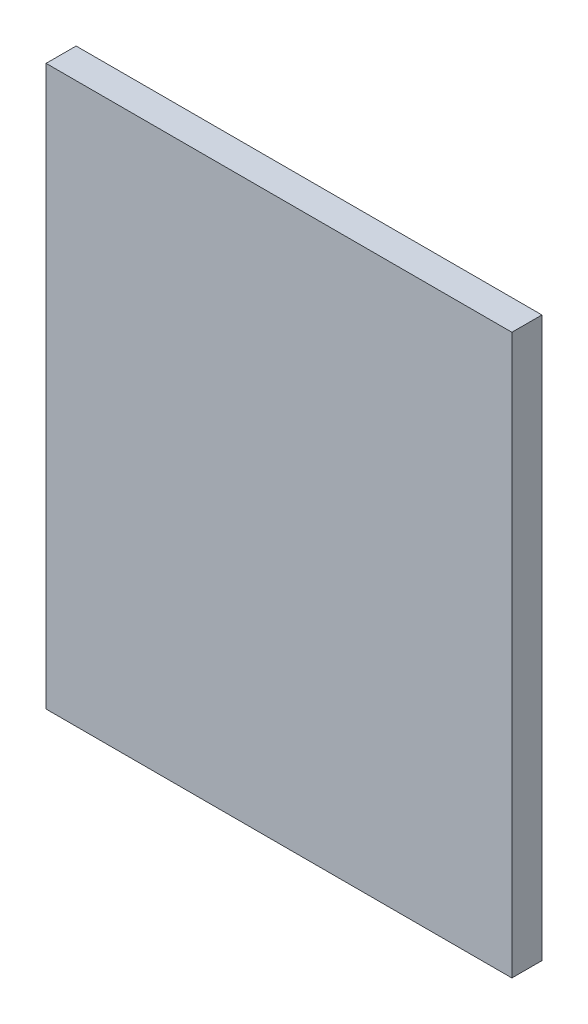
ISO-10303-21;
HEADER;
FILE_DESCRIPTION(('STEP AP214'),'2;1');
FILE_NAME('part.step','',(''),(''),'','','');
FILE_SCHEMA(('AUTOMOTIVE_DESIGN { 1 0 10303 214 1 1 1 1 }'));
ENDSEC;
DATA;
#1=APPLICATION_CONTEXT('core data for automotive mechanical design processes');
#2=APPLICATION_PROTOCOL_DEFINITION('international standard','automotive_design',2000,#1);
#3=PRODUCT_CONTEXT('',#1,'mechanical');
#4=PRODUCT('Part','Part','',(#3));
#5=PRODUCT_RELATED_PRODUCT_CATEGORY('part','',(#4));
#6=PRODUCT_DEFINITION_FORMATION('','',#4);
#7=PRODUCT_DEFINITION_CONTEXT('part definition',#1,'design');
#8=PRODUCT_DEFINITION('design','',#6,#7);
#9=PRODUCT_DEFINITION_SHAPE('','',#8);
#10=(LENGTH_UNIT() NAMED_UNIT(*) SI_UNIT(.MILLI.,.METRE.));
#11=(NAMED_UNIT(*) PLANE_ANGLE_UNIT() SI_UNIT($,.RADIAN.));
#12=(NAMED_UNIT(*) SI_UNIT($,.STERADIAN.) SOLID_ANGLE_UNIT());
#13=UNCERTAINTY_MEASURE_WITH_UNIT(LENGTH_MEASURE(1.E-05),#10,'distance_accuracy_value','');
#14=(GEOMETRIC_REPRESENTATION_CONTEXT(3) GLOBAL_UNCERTAINTY_ASSIGNED_CONTEXT((#13)) GLOBAL_UNIT_ASSIGNED_CONTEXT((#10,
#11,#12)) REPRESENTATION_CONTEXT('',''));
#15=CARTESIAN_POINT('',(0.,0.,0.));
#16=DIRECTION('',(0.,0.,1.));
#17=DIRECTION('',(1.,0.,0.));
#18=AXIS2_PLACEMENT_3D('',#15,#16,#17);
#19=CARTESIAN_POINT('',(0.,8.38000000170986,0.45));
#20=DIRECTION('',(0.,1.,0.));
#21=DIRECTION('',(-1.,0.,0.));
#22=AXIS2_PLACEMENT_3D('',#19,#20,#21);
#23=PLANE('',#22);
#24=DIRECTION('',(1.,0.,0.));
#25=VECTOR('',#24,1.);
#26=CARTESIAN_POINT('',(0.,8.38000000170986,0.));
#27=LINE('',#26,#25);
#28=CARTESIAN_POINT('',(0.,8.38000000170986,0.));
#29=VERTEX_POINT('',#28);
#30=CARTESIAN_POINT('',(6.98000000107195,8.38000000170986,0.));
#31=VERTEX_POINT('',#30);
#32=EDGE_CURVE('E96',#29,#31,#27,.T.);
#33=ORIENTED_EDGE('',*,*,#32,.F.);
#34=DIRECTION('',(0.,0.,-1.));
#35=VECTOR('',#34,1.);
#36=CARTESIAN_POINT('',(0.,8.38000000170986,0.45));
#37=LINE('',#36,#35);
#38=CARTESIAN_POINT('',(0.,8.38000000170986,0.45));
#39=VERTEX_POINT('',#38);
#40=EDGE_CURVE('E11',#39,#29,#37,.T.);
#41=ORIENTED_EDGE('',*,*,#40,.F.);
#42=DIRECTION('',(1.,0.,0.));
#43=VECTOR('',#42,1.);
#44=CARTESIAN_POINT('',(0.,8.38000000170986,0.45));
#45=LINE('',#44,#43);
#46=CARTESIAN_POINT('',(6.98000000107195,8.38000000170986,0.45));
#47=VERTEX_POINT('',#46);
#48=EDGE_CURVE('E90',#39,#47,#45,.T.);
#49=ORIENTED_EDGE('',*,*,#48,.T.);
#50=DIRECTION('',(0.,0.,-1.));
#51=VECTOR('',#50,1.);
#52=CARTESIAN_POINT('',(6.98000000107195,8.38000000170986,0.45));
#53=LINE('',#52,#51);
#54=EDGE_CURVE('E35',#47,#31,#53,.T.);
#55=ORIENTED_EDGE('',*,*,#54,.T.);
#56=EDGE_LOOP('',(#33,#41,#49,#55));
#57=FACE_BOUND('',#56,.T.);
#58=ADVANCED_FACE('F32',(#57),#23,.T.);
#59=CARTESIAN_POINT('',(0.,0.,0.45));
#60=DIRECTION('',(-1.,0.,0.));
#61=DIRECTION('',(0.,-1.,0.));
#62=AXIS2_PLACEMENT_3D('',#59,#60,#61);
#63=PLANE('',#62);
#64=DIRECTION('',(0.,1.,0.));
#65=VECTOR('',#64,1.);
#66=CARTESIAN_POINT('',(0.,0.,0.));
#67=LINE('',#66,#65);
#68=CARTESIAN_POINT('',(0.,0.,0.));
#69=VERTEX_POINT('',#68);
#70=EDGE_CURVE('E92',#69,#29,#67,.T.);
#71=ORIENTED_EDGE('',*,*,#70,.F.);
#72=DIRECTION('',(0.,0.,-1.));
#73=VECTOR('',#72,1.);
#74=CARTESIAN_POINT('',(0.,0.,0.45));
#75=LINE('',#74,#73);
#76=CARTESIAN_POINT('',(0.,0.,0.45));
#77=VERTEX_POINT('',#76);
#78=EDGE_CURVE('E41',#77,#69,#75,.T.);
#79=ORIENTED_EDGE('',*,*,#78,.F.);
#80=DIRECTION('',(0.,1.,0.));
#81=VECTOR('',#80,1.);
#82=CARTESIAN_POINT('',(0.,0.,0.45));
#83=LINE('',#82,#81);
#84=EDGE_CURVE('E87',#77,#39,#83,.T.);
#85=ORIENTED_EDGE('',*,*,#84,.T.);
#86=ORIENTED_EDGE('',*,*,#40,.T.);
#87=EDGE_LOOP('',(#71,#79,#85,#86));
#88=FACE_BOUND('',#87,.T.);
#89=ADVANCED_FACE('F106',(#88),#63,.T.);
#90=CARTESIAN_POINT('',(6.98000000107195,0.,0.45));
#91=DIRECTION('',(0.,-1.,0.));
#92=DIRECTION('',(1.,0.,0.));
#93=AXIS2_PLACEMENT_3D('',#90,#91,#92);
#94=PLANE('',#93);
#95=DIRECTION('',(-1.,0.,0.));
#96=VECTOR('',#95,1.);
#97=CARTESIAN_POINT('',(6.98000000107195,0.,0.));
#98=LINE('',#97,#96);
#99=CARTESIAN_POINT('',(6.98000000107195,0.,0.));
#100=VERTEX_POINT('',#99);
#101=EDGE_CURVE('E82',#100,#69,#98,.T.);
#102=ORIENTED_EDGE('',*,*,#101,.F.);
#103=DIRECTION('',(0.,0.,-1.));
#104=VECTOR('',#103,1.);
#105=CARTESIAN_POINT('',(6.98000000107195,0.,0.45));
#106=LINE('',#105,#104);
#107=CARTESIAN_POINT('',(6.98000000107195,0.,0.45));
#108=VERTEX_POINT('',#107);
#109=EDGE_CURVE('E77',#108,#100,#106,.T.);
#110=ORIENTED_EDGE('',*,*,#109,.F.);
#111=DIRECTION('',(-1.,0.,0.));
#112=VECTOR('',#111,1.);
#113=CARTESIAN_POINT('',(6.98000000107195,0.,0.45));
#114=LINE('',#113,#112);
#115=EDGE_CURVE('E80',#108,#77,#114,.T.);
#116=ORIENTED_EDGE('',*,*,#115,.T.);
#117=ORIENTED_EDGE('',*,*,#78,.T.);
#118=EDGE_LOOP('',(#102,#110,#116,#117));
#119=FACE_BOUND('',#118,.T.);
#120=ADVANCED_FACE('F79',(#119),#94,.T.);
#121=CARTESIAN_POINT('',(6.98000000107195,8.38000000170986,0.45));
#122=DIRECTION('',(1.,0.,0.));
#123=DIRECTION('',(0.,1.,0.));
#124=AXIS2_PLACEMENT_3D('',#121,#122,#123);
#125=PLANE('',#124);
#126=DIRECTION('',(0.,-1.,0.));
#127=VECTOR('',#126,1.);
#128=CARTESIAN_POINT('',(6.98000000107195,8.38000000170986,0.));
#129=LINE('',#128,#127);
#130=EDGE_CURVE('E99',#31,#100,#129,.T.);
#131=ORIENTED_EDGE('',*,*,#130,.F.);
#132=ORIENTED_EDGE('',*,*,#54,.F.);
#133=DIRECTION('',(0.,-1.,0.));
#134=VECTOR('',#133,1.);
#135=CARTESIAN_POINT('',(6.98000000107195,8.38000000170986,0.45));
#136=LINE('',#135,#134);
#137=EDGE_CURVE('E86',#47,#108,#136,.T.);
#138=ORIENTED_EDGE('',*,*,#137,.T.);
#139=ORIENTED_EDGE('',*,*,#109,.T.);
#140=EDGE_LOOP('',(#131,#132,#138,#139));
#141=FACE_BOUND('',#140,.T.);
#142=ADVANCED_FACE('F89',(#141),#125,.T.);
#143=CARTESIAN_POINT('',(0.,0.,0.45));
#144=DIRECTION('',(0.,0.,-1.));
#145=DIRECTION('',(-1.,0.,0.));
#146=AXIS2_PLACEMENT_3D('',#143,#144,#145);
#147=PLANE('',#146);
#148=ORIENTED_EDGE('',*,*,#48,.F.);
#149=ORIENTED_EDGE('',*,*,#84,.F.);
#150=ORIENTED_EDGE('',*,*,#115,.F.);
#151=ORIENTED_EDGE('',*,*,#137,.F.);
#152=EDGE_LOOP('',(#148,#149,#150,#151));
#153=FACE_BOUND('',#152,.T.);
#154=ADVANCED_FACE('F85',(#153),#147,.F.);
#155=CARTESIAN_POINT('',(0.,0.,0.));
#156=DIRECTION('',(0.,0.,-1.));
#157=DIRECTION('',(-1.,0.,0.));
#158=AXIS2_PLACEMENT_3D('',#155,#156,#157);
#159=PLANE('',#158);
#160=ORIENTED_EDGE('',*,*,#32,.T.);
#161=ORIENTED_EDGE('',*,*,#130,.T.);
#162=ORIENTED_EDGE('',*,*,#101,.T.);
#163=ORIENTED_EDGE('',*,*,#70,.T.);
#164=EDGE_LOOP('',(#160,#161,#162,#163));
#165=FACE_BOUND('',#164,.T.);
#166=ADVANCED_FACE('F105',(#165),#159,.T.);
#167=CLOSED_SHELL('',(#58,#89,#120,#142,#154,#166));
#168=MANIFOLD_SOLID_BREP('B2',#167);
#169=ADVANCED_BREP_SHAPE_REPRESENTATION('',(#18,#168),#14);
#170=SHAPE_DEFINITION_REPRESENTATION(#9,#169);
ENDSEC;
END-ISO-10303-21;
